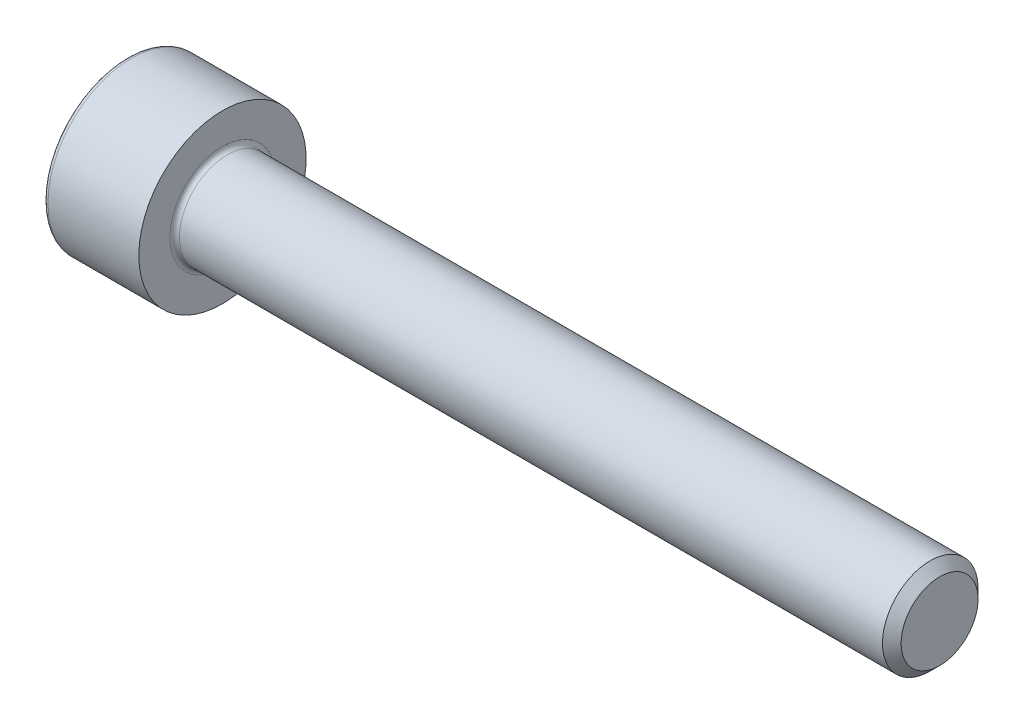
ISO-10303-21;
HEADER;
FILE_DESCRIPTION(('STEP AP214'),'2;1');
FILE_NAME('part.step','',(''),(''),'','','');
FILE_SCHEMA(('AUTOMOTIVE_DESIGN { 1 0 10303 214 1 1 1 1 }'));
ENDSEC;
DATA;
#1=APPLICATION_CONTEXT('core data for automotive mechanical design processes');
#2=APPLICATION_PROTOCOL_DEFINITION('international standard','automotive_design',2000,#1);
#3=PRODUCT_CONTEXT('',#1,'mechanical');
#4=PRODUCT('Part','Part','',(#3));
#5=PRODUCT_RELATED_PRODUCT_CATEGORY('part','',(#4));
#6=PRODUCT_DEFINITION_FORMATION('','',#4);
#7=PRODUCT_DEFINITION_CONTEXT('part definition',#1,'design');
#8=PRODUCT_DEFINITION('design','',#6,#7);
#9=PRODUCT_DEFINITION_SHAPE('','',#8);
#10=(LENGTH_UNIT() NAMED_UNIT(*) SI_UNIT(.MILLI.,.METRE.));
#11=(NAMED_UNIT(*) PLANE_ANGLE_UNIT() SI_UNIT($,.RADIAN.));
#12=(NAMED_UNIT(*) SI_UNIT($,.STERADIAN.) SOLID_ANGLE_UNIT());
#13=UNCERTAINTY_MEASURE_WITH_UNIT(LENGTH_MEASURE(1.E-05),#10,'distance_accuracy_value','');
#14=(GEOMETRIC_REPRESENTATION_CONTEXT(3) GLOBAL_UNCERTAINTY_ASSIGNED_CONTEXT((#13)) GLOBAL_UNIT_ASSIGNED_CONTEXT((#10,
#11,#12)) REPRESENTATION_CONTEXT('',''));
#15=CARTESIAN_POINT('',(0.,0.,0.));
#16=DIRECTION('',(0.,0.,1.));
#17=DIRECTION('',(1.,0.,0.));
#18=AXIS2_PLACEMENT_3D('',#15,#16,#17);
#19=CARTESIAN_POINT('',(0.,0.,0.));
#20=DIRECTION('',(-1.,0.,0.));
#21=DIRECTION('',(0.,0.,1.));
#22=AXIS2_PLACEMENT_3D('',#19,#20,#21);
#23=PLANE('',#22);
#24=DIRECTION('',(0.,-0.499999999999999,0.866025403784439));
#25=VECTOR('',#24,1.);
#26=CARTESIAN_POINT('',(0.,1.77304267668134,0.));
#27=LINE('',#26,#25);
#28=CARTESIAN_POINT('',(0.,1.77304267668134,0.));
#29=VERTEX_POINT('',#28);
#30=CARTESIAN_POINT('',(0.,0.886521338340669,1.5355));
#31=VERTEX_POINT('',#30);
#32=EDGE_CURVE('E259',#29,#31,#27,.T.);
#33=ORIENTED_EDGE('',*,*,#32,.T.);
#34=DIRECTION('',(0.,1.,0.));
#35=VECTOR('',#34,1.);
#36=CARTESIAN_POINT('',(0.,-0.886521338340673,1.5355));
#37=LINE('',#36,#35);
#38=CARTESIAN_POINT('',(0.,-0.886521338340673,1.5355));
#39=VERTEX_POINT('',#38);
#40=EDGE_CURVE('E131',#39,#31,#37,.T.);
#41=ORIENTED_EDGE('',*,*,#40,.F.);
#42=DIRECTION('',(0.,-0.500000000000001,-0.866025403784438));
#43=VECTOR('',#42,1.);
#44=CARTESIAN_POINT('',(0.,-0.886521338340673,1.5355));
#45=LINE('',#44,#43);
#46=CARTESIAN_POINT('',(0.,-1.77304267668134,0.));
#47=VERTEX_POINT('',#46);
#48=EDGE_CURVE('E262',#39,#47,#45,.T.);
#49=ORIENTED_EDGE('',*,*,#48,.T.);
#50=DIRECTION('',(0.,0.499999999999999,-0.866025403784439));
#51=VECTOR('',#50,1.);
#52=CARTESIAN_POINT('',(0.,-1.77304267668134,0.));
#53=LINE('',#52,#51);
#54=CARTESIAN_POINT('',(0.,-0.886521338340676,-1.5355));
#55=VERTEX_POINT('',#54);
#56=EDGE_CURVE('E265',#47,#55,#53,.T.);
#57=ORIENTED_EDGE('',*,*,#56,.T.);
#58=DIRECTION('',(0.,-1.,0.));
#59=VECTOR('',#58,1.);
#60=CARTESIAN_POINT('',(0.,0.886521338340665,-1.5355));
#61=LINE('',#60,#59);
#62=CARTESIAN_POINT('',(0.,0.886521338340665,-1.5355));
#63=VERTEX_POINT('',#62);
#64=EDGE_CURVE('E268',#63,#55,#61,.T.);
#65=ORIENTED_EDGE('',*,*,#64,.F.);
#66=DIRECTION('',(0.,-0.500000000000001,-0.866025403784438));
#67=VECTOR('',#66,1.);
#68=CARTESIAN_POINT('',(0.,1.77304267668134,0.));
#69=LINE('',#68,#67);
#70=EDGE_CURVE('E126',#29,#63,#69,.T.);
#71=ORIENTED_EDGE('',*,*,#70,.F.);
#72=EDGE_LOOP('',(#33,#41,#49,#57,#65,#71));
#73=FACE_BOUND('',#72,.T.);
#74=CARTESIAN_POINT('',(0.,0.,0.));
#75=DIRECTION('',(-1.,0.,0.));
#76=DIRECTION('',(0.,0.,1.));
#77=AXIS2_PLACEMENT_3D('',#74,#75,#76);
#78=CIRCLE('',#77,3.3);
#79=CARTESIAN_POINT('',(0.,0.,3.3));
#80=VERTEX_POINT('',#79);
#81=EDGE_CURVE('E43',#80,#80,#78,.T.);
#82=ORIENTED_EDGE('',*,*,#81,.T.);
#83=EDGE_LOOP('',(#82));
#84=FACE_BOUND('',#83,.T.);
#85=ADVANCED_FACE('F35',(#73,#84),#23,.T.);
#86=CARTESIAN_POINT('',(-31.75,0.,0.));
#87=DIRECTION('',(-1.,0.,0.));
#88=DIRECTION('',(0.,0.,1.));
#89=AXIS2_PLACEMENT_3D('',#86,#87,#88);
#90=CYLINDRICAL_SURFACE('',#89,3.5);
#91=CARTESIAN_POINT('',(0.199999999999999,0.,0.));
#92=DIRECTION('',(-1.,0.,0.));
#93=DIRECTION('',(0.,0.,1.));
#94=AXIS2_PLACEMENT_3D('',#91,#92,#93);
#95=CIRCLE('',#94,3.5);
#96=CARTESIAN_POINT('',(0.199999999999999,0.,3.5));
#97=VERTEX_POINT('',#96);
#98=EDGE_CURVE('E11',#97,#97,#95,.F.);
#99=ORIENTED_EDGE('',*,*,#98,.T.);
#100=EDGE_LOOP('',(#99));
#101=FACE_BOUND('',#100,.T.);
#102=CARTESIAN_POINT('',(4.,0.,0.));
#103=DIRECTION('',(-1.,0.,0.));
#104=DIRECTION('',(0.,0.,1.));
#105=AXIS2_PLACEMENT_3D('',#102,#103,#104);
#106=CIRCLE('',#105,3.5);
#107=CARTESIAN_POINT('',(4.,0.,3.5));
#108=VERTEX_POINT('',#107);
#109=EDGE_CURVE('E149',#108,#108,#106,.T.);
#110=ORIENTED_EDGE('',*,*,#109,.T.);
#111=EDGE_LOOP('',(#110));
#112=FACE_BOUND('',#111,.T.);
#113=ADVANCED_FACE('F173',(#101,#112),#90,.T.);
#114=CARTESIAN_POINT('',(4.,3.5,0.));
#115=DIRECTION('',(1.,0.,0.));
#116=DIRECTION('',(0.,0.,-1.));
#117=AXIS2_PLACEMENT_3D('',#114,#115,#116);
#118=PLANE('',#117);
#119=CARTESIAN_POINT('',(4.,0.,0.));
#120=DIRECTION('',(1.,0.,0.));
#121=DIRECTION('',(0.,0.,-1.));
#122=AXIS2_PLACEMENT_3D('',#119,#120,#121);
#123=CIRCLE('',#122,2.19999999999997);
#124=CARTESIAN_POINT('',(4.,0.,-2.19999999999997));
#125=VERTEX_POINT('',#124);
#126=EDGE_CURVE('E152',#125,#125,#123,.F.);
#127=ORIENTED_EDGE('',*,*,#126,.T.);
#128=EDGE_LOOP('',(#127));
#129=FACE_BOUND('',#128,.T.);
#130=ORIENTED_EDGE('',*,*,#109,.F.);
#131=EDGE_LOOP('',(#130));
#132=FACE_BOUND('',#131,.T.);
#133=ADVANCED_FACE('F179',(#129,#132),#118,.T.);
#134=CARTESIAN_POINT('',(-31.75,0.,0.));
#135=DIRECTION('',(-1.,0.,0.));
#136=DIRECTION('',(0.,0.,1.));
#137=AXIS2_PLACEMENT_3D('',#134,#135,#136);
#138=CYLINDRICAL_SURFACE('',#137,1.99999999999997);
#139=CARTESIAN_POINT('',(4.2,0.,0.));
#140=DIRECTION('',(1.,0.,0.));
#141=DIRECTION('',(0.,0.,-1.));
#142=AXIS2_PLACEMENT_3D('',#139,#140,#141);
#143=CIRCLE('',#142,1.99999999999997);
#144=CARTESIAN_POINT('',(4.2,0.,-1.99999999999997));
#145=VERTEX_POINT('',#144);
#146=EDGE_CURVE('E155',#145,#145,#143,.T.);
#147=ORIENTED_EDGE('',*,*,#146,.T.);
#148=EDGE_LOOP('',(#147));
#149=FACE_BOUND('',#148,.T.);
#150=CARTESIAN_POINT('',(33.61,0.,0.));
#151=DIRECTION('',(-1.,0.,0.));
#152=DIRECTION('',(0.,0.,1.));
#153=AXIS2_PLACEMENT_3D('',#150,#151,#152);
#154=CIRCLE('',#153,1.99999999999994);
#155=CARTESIAN_POINT('',(33.61,0.,1.99999999999994));
#156=VERTEX_POINT('',#155);
#157=EDGE_CURVE('E146',#156,#156,#154,.T.);
#158=ORIENTED_EDGE('',*,*,#157,.T.);
#159=EDGE_LOOP('',(#158));
#160=FACE_BOUND('',#159,.T.);
#161=ADVANCED_FACE('F185',(#149,#160),#138,.T.);
#162=CARTESIAN_POINT('',(34.,0.,0.));
#163=DIRECTION('',(-1.,0.,0.));
#164=DIRECTION('',(0.,0.,1.));
#165=AXIS2_PLACEMENT_3D('',#162,#163,#164);
#166=CONICAL_SURFACE('',#165,1.61,0.785398163397317);
#167=ORIENTED_EDGE('',*,*,#157,.F.);
#168=EDGE_LOOP('',(#167));
#169=FACE_BOUND('',#168,.T.);
#170=CARTESIAN_POINT('',(34.,0.,0.));
#171=DIRECTION('',(-1.,0.,0.));
#172=DIRECTION('',(0.,0.,1.));
#173=AXIS2_PLACEMENT_3D('',#170,#171,#172);
#174=CIRCLE('',#173,1.61);
#175=CARTESIAN_POINT('',(34.,0.,1.61));
#176=VERTEX_POINT('',#175);
#177=EDGE_CURVE('E142',#176,#176,#174,.T.);
#178=ORIENTED_EDGE('',*,*,#177,.T.);
#179=EDGE_LOOP('',(#178));
#180=FACE_BOUND('',#179,.T.);
#181=ADVANCED_FACE('F189',(#169,#180),#166,.T.);
#182=CARTESIAN_POINT('',(34.,1.61,0.));
#183=DIRECTION('',(1.,0.,0.));
#184=DIRECTION('',(0.,0.,-1.));
#185=AXIS2_PLACEMENT_3D('',#182,#183,#184);
#186=PLANE('',#185);
#187=ORIENTED_EDGE('',*,*,#177,.F.);
#188=EDGE_LOOP('',(#187));
#189=FACE_BOUND('',#188,.T.);
#190=ADVANCED_FACE('F169',(#189),#186,.T.);
#191=CARTESIAN_POINT('',(4.2,0.,0.));
#192=DIRECTION('',(1.,0.,0.));
#193=DIRECTION('',(0.,0.,-1.));
#194=AXIS2_PLACEMENT_3D('',#191,#192,#193);
#195=TOROIDAL_SURFACE('',#194,2.19999999999997,0.2);
#196=ORIENTED_EDGE('',*,*,#146,.F.);
#197=EDGE_LOOP('',(#196));
#198=FACE_BOUND('',#197,.T.);
#199=ORIENTED_EDGE('',*,*,#126,.F.);
#200=EDGE_LOOP('',(#199));
#201=FACE_BOUND('',#200,.T.);
#202=ADVANCED_FACE('F162',(#198,#201),#195,.F.);
#203=CARTESIAN_POINT('',(0.199999999999999,0.,0.));
#204=DIRECTION('',(-1.,0.,0.));
#205=DIRECTION('',(0.,0.,1.));
#206=AXIS2_PLACEMENT_3D('',#203,#204,#205);
#207=TOROIDAL_SURFACE('',#206,3.3,0.2);
#208=ORIENTED_EDGE('',*,*,#98,.F.);
#209=EDGE_LOOP('',(#208));
#210=FACE_BOUND('',#209,.T.);
#211=ORIENTED_EDGE('',*,*,#81,.F.);
#212=EDGE_LOOP('',(#211));
#213=FACE_BOUND('',#212,.T.);
#214=ADVANCED_FACE('F37',(#210,#213),#207,.T.);
#215=CARTESIAN_POINT('',(2.,1.77304267668134,0.));
#216=DIRECTION('',(0.,-0.866025403784439,-0.5));
#217=DIRECTION('',(0.,0.499999999999999,-0.866025403784439));
#218=AXIS2_PLACEMENT_3D('',#215,#216,#217);
#219=PLANE('',#218);
#220=ORIENTED_EDGE('',*,*,#32,.F.);
#221=DIRECTION('',(-1.,0.,0.));
#222=VECTOR('',#221,1.);
#223=CARTESIAN_POINT('',(2.,1.77304267668134,0.));
#224=LINE('',#223,#222);
#225=CARTESIAN_POINT('',(2.,1.77304267668134,0.));
#226=VERTEX_POINT('',#225);
#227=EDGE_CURVE('E249',#226,#29,#224,.T.);
#228=ORIENTED_EDGE('',*,*,#227,.F.);
#229=DIRECTION('',(0.,-0.499999999999999,0.866025403784439));
#230=VECTOR('',#229,1.);
#231=CARTESIAN_POINT('',(2.,1.77304267668134,0.));
#232=LINE('',#231,#230);
#233=CARTESIAN_POINT('',(2.,1.329782007511,0.767749999999997));
#234=VERTEX_POINT('',#233);
#235=EDGE_CURVE('E118',#226,#234,#232,.T.);
#236=ORIENTED_EDGE('',*,*,#235,.T.);
#237=CARTESIAN_POINT('',(2.,0.886521338340669,1.5355));
#238=VERTEX_POINT('',#237);
#239=EDGE_CURVE('E109',#234,#238,#232,.T.);
#240=ORIENTED_EDGE('',*,*,#239,.T.);
#241=DIRECTION('',(-1.,0.,0.));
#242=VECTOR('',#241,1.);
#243=CARTESIAN_POINT('',(2.,0.886521338340669,1.5355));
#244=LINE('',#243,#242);
#245=EDGE_CURVE('E123',#238,#31,#244,.T.);
#246=ORIENTED_EDGE('',*,*,#245,.T.);
#247=EDGE_LOOP('',(#220,#228,#236,#240,#246));
#248=FACE_BOUND('',#247,.T.);
#249=ADVANCED_FACE('F122',(#248),#219,.T.);
#250=CARTESIAN_POINT('',(2.,-0.886521338340673,1.5355));
#251=DIRECTION('',(0.,0.,1.));
#252=DIRECTION('',(0.,-1.,0.));
#253=AXIS2_PLACEMENT_3D('',#250,#251,#252);
#254=PLANE('',#253);
#255=ORIENTED_EDGE('',*,*,#40,.T.);
#256=ORIENTED_EDGE('',*,*,#245,.F.);
#257=DIRECTION('',(0.,1.,0.));
#258=VECTOR('',#257,1.);
#259=CARTESIAN_POINT('',(2.,-0.886521338340673,1.5355));
#260=LINE('',#259,#258);
#261=CARTESIAN_POINT('',(2.,0.,1.5355));
#262=VERTEX_POINT('',#261);
#263=EDGE_CURVE('E106',#262,#238,#260,.T.);
#264=ORIENTED_EDGE('',*,*,#263,.F.);
#265=CARTESIAN_POINT('',(2.,-0.886521338340673,1.5355));
#266=VERTEX_POINT('',#265);
#267=EDGE_CURVE('E117',#266,#262,#260,.T.);
#268=ORIENTED_EDGE('',*,*,#267,.F.);
#269=DIRECTION('',(-1.,0.,0.));
#270=VECTOR('',#269,1.);
#271=CARTESIAN_POINT('',(2.,-0.886521338340673,1.5355));
#272=LINE('',#271,#270);
#273=EDGE_CURVE('E133',#266,#39,#272,.T.);
#274=ORIENTED_EDGE('',*,*,#273,.T.);
#275=EDGE_LOOP('',(#255,#256,#264,#268,#274));
#276=FACE_BOUND('',#275,.T.);
#277=ADVANCED_FACE('F128',(#276),#254,.F.);
#278=CARTESIAN_POINT('',(2.,-0.886521338340673,1.5355));
#279=DIRECTION('',(0.,0.866025403784438,-0.500000000000001));
#280=DIRECTION('',(0.,0.500000000000001,0.866025403784438));
#281=AXIS2_PLACEMENT_3D('',#278,#279,#280);
#282=PLANE('',#281);
#283=ORIENTED_EDGE('',*,*,#48,.F.);
#284=ORIENTED_EDGE('',*,*,#273,.F.);
#285=DIRECTION('',(0.,-0.500000000000001,-0.866025403784438));
#286=VECTOR('',#285,1.);
#287=CARTESIAN_POINT('',(2.,-0.886521338340673,1.5355));
#288=LINE('',#287,#286);
#289=CARTESIAN_POINT('',(2.,-1.32978200751101,0.767750000000003));
#290=VERTEX_POINT('',#289);
#291=EDGE_CURVE('E288',#266,#290,#288,.T.);
#292=ORIENTED_EDGE('',*,*,#291,.T.);
#293=CARTESIAN_POINT('',(2.,-1.77304267668134,0.));
#294=VERTEX_POINT('',#293);
#295=EDGE_CURVE('E277',#290,#294,#288,.T.);
#296=ORIENTED_EDGE('',*,*,#295,.T.);
#297=DIRECTION('',(-1.,0.,0.));
#298=VECTOR('',#297,1.);
#299=CARTESIAN_POINT('',(2.,-1.77304267668134,0.));
#300=LINE('',#299,#298);
#301=EDGE_CURVE('E138',#294,#47,#300,.T.);
#302=ORIENTED_EDGE('',*,*,#301,.T.);
#303=EDGE_LOOP('',(#283,#284,#292,#296,#302));
#304=FACE_BOUND('',#303,.T.);
#305=ADVANCED_FACE('F203',(#304),#282,.T.);
#306=CARTESIAN_POINT('',(2.,-1.77304267668134,0.));
#307=DIRECTION('',(0.,0.866025403784439,0.499999999999999));
#308=DIRECTION('',(0.,-0.499999999999999,0.866025403784439));
#309=AXIS2_PLACEMENT_3D('',#306,#307,#308);
#310=PLANE('',#309);
#311=ORIENTED_EDGE('',*,*,#56,.F.);
#312=ORIENTED_EDGE('',*,*,#301,.F.);
#313=DIRECTION('',(0.,0.499999999999999,-0.866025403784439));
#314=VECTOR('',#313,1.);
#315=CARTESIAN_POINT('',(2.,-1.77304267668134,0.));
#316=LINE('',#315,#314);
#317=CARTESIAN_POINT('',(2.,-1.32978200751101,-0.767750000000001));
#318=VERTEX_POINT('',#317);
#319=EDGE_CURVE('E255',#294,#318,#316,.T.);
#320=ORIENTED_EDGE('',*,*,#319,.T.);
#321=CARTESIAN_POINT('',(2.,-0.886521338340676,-1.5355));
#322=VERTEX_POINT('',#321);
#323=EDGE_CURVE('E287',#318,#322,#316,.T.);
#324=ORIENTED_EDGE('',*,*,#323,.T.);
#325=DIRECTION('',(-1.,0.,0.));
#326=VECTOR('',#325,1.);
#327=CARTESIAN_POINT('',(2.,-0.886521338340676,-1.5355));
#328=LINE('',#327,#326);
#329=EDGE_CURVE('E248',#322,#55,#328,.T.);
#330=ORIENTED_EDGE('',*,*,#329,.T.);
#331=EDGE_LOOP('',(#311,#312,#320,#324,#330));
#332=FACE_BOUND('',#331,.T.);
#333=ADVANCED_FACE('F206',(#332),#310,.T.);
#334=CARTESIAN_POINT('',(2.,0.886521338340665,-1.5355));
#335=DIRECTION('',(0.,0.,-1.));
#336=DIRECTION('',(0.,1.,0.));
#337=AXIS2_PLACEMENT_3D('',#334,#335,#336);
#338=PLANE('',#337);
#339=ORIENTED_EDGE('',*,*,#64,.T.);
#340=ORIENTED_EDGE('',*,*,#329,.F.);
#341=DIRECTION('',(0.,-1.,0.));
#342=VECTOR('',#341,1.);
#343=CARTESIAN_POINT('',(2.,0.886521338340665,-1.5355));
#344=LINE('',#343,#342);
#345=CARTESIAN_POINT('',(2.,0.,-1.5355));
#346=VERTEX_POINT('',#345);
#347=EDGE_CURVE('E252',#346,#322,#344,.T.);
#348=ORIENTED_EDGE('',*,*,#347,.F.);
#349=CARTESIAN_POINT('',(2.,0.886521338340665,-1.5355));
#350=VERTEX_POINT('',#349);
#351=EDGE_CURVE('E50',#350,#346,#344,.T.);
#352=ORIENTED_EDGE('',*,*,#351,.F.);
#353=DIRECTION('',(-1.,0.,0.));
#354=VECTOR('',#353,1.);
#355=CARTESIAN_POINT('',(2.,0.886521338340665,-1.5355));
#356=LINE('',#355,#354);
#357=EDGE_CURVE('E245',#350,#63,#356,.T.);
#358=ORIENTED_EDGE('',*,*,#357,.T.);
#359=EDGE_LOOP('',(#339,#340,#348,#352,#358));
#360=FACE_BOUND('',#359,.T.);
#361=ADVANCED_FACE('F210',(#360),#338,.F.);
#362=CARTESIAN_POINT('',(2.,1.77304267668134,0.));
#363=DIRECTION('',(0.,0.866025403784438,-0.500000000000001));
#364=DIRECTION('',(0.,0.500000000000001,0.866025403784438));
#365=AXIS2_PLACEMENT_3D('',#362,#363,#364);
#366=PLANE('',#365);
#367=ORIENTED_EDGE('',*,*,#70,.T.);
#368=ORIENTED_EDGE('',*,*,#357,.F.);
#369=DIRECTION('',(0.,-0.500000000000001,-0.866025403784438));
#370=VECTOR('',#369,1.);
#371=CARTESIAN_POINT('',(2.,1.77304267668134,0.));
#372=LINE('',#371,#370);
#373=CARTESIAN_POINT('',(2.,1.329782007511,-0.767750000000001));
#374=VERTEX_POINT('',#373);
#375=EDGE_CURVE('E235',#374,#350,#372,.T.);
#376=ORIENTED_EDGE('',*,*,#375,.F.);
#377=EDGE_CURVE('E241',#226,#374,#372,.T.);
#378=ORIENTED_EDGE('',*,*,#377,.F.);
#379=ORIENTED_EDGE('',*,*,#227,.T.);
#380=EDGE_LOOP('',(#367,#368,#376,#378,#379));
#381=FACE_BOUND('',#380,.T.);
#382=ADVANCED_FACE('F214',(#381),#366,.F.);
#383=CARTESIAN_POINT('',(2.,1.77304267668134,0.));
#384=DIRECTION('',(1.,0.,0.));
#385=DIRECTION('',(0.,0.,-1.));
#386=AXIS2_PLACEMENT_3D('',#383,#384,#385);
#387=PLANE('',#386);
#388=ORIENTED_EDGE('',*,*,#347,.T.);
#389=ORIENTED_EDGE('',*,*,#323,.F.);
#390=CARTESIAN_POINT('',(2.,0.,0.));
#391=DIRECTION('',(-1.,0.,0.));
#392=DIRECTION('',(0.,0.,1.));
#393=AXIS2_PLACEMENT_3D('',#390,#391,#392);
#394=CIRCLE('',#393,1.5355);
#395=EDGE_CURVE('E283',#346,#318,#394,.T.);
#396=ORIENTED_EDGE('',*,*,#395,.F.);
#397=EDGE_LOOP('',(#388,#389,#396));
#398=FACE_BOUND('',#397,.T.);
#399=ADVANCED_FACE('F218',(#398),#387,.F.);
#400=ORIENTED_EDGE('',*,*,#319,.F.);
#401=ORIENTED_EDGE('',*,*,#295,.F.);
#402=EDGE_CURVE('E136',#318,#290,#394,.T.);
#403=ORIENTED_EDGE('',*,*,#402,.F.);
#404=EDGE_LOOP('',(#400,#401,#403));
#405=FACE_BOUND('',#404,.T.);
#406=ADVANCED_FACE('F221',(#405),#387,.F.);
#407=ORIENTED_EDGE('',*,*,#291,.F.);
#408=ORIENTED_EDGE('',*,*,#267,.T.);
#409=EDGE_CURVE('E132',#290,#262,#394,.T.);
#410=ORIENTED_EDGE('',*,*,#409,.F.);
#411=EDGE_LOOP('',(#407,#408,#410));
#412=FACE_BOUND('',#411,.T.);
#413=ADVANCED_FACE('F226',(#412),#387,.F.);
#414=ORIENTED_EDGE('',*,*,#263,.T.);
#415=ORIENTED_EDGE('',*,*,#239,.F.);
#416=EDGE_CURVE('E112',#262,#234,#394,.T.);
#417=ORIENTED_EDGE('',*,*,#416,.F.);
#418=EDGE_LOOP('',(#414,#415,#417));
#419=FACE_BOUND('',#418,.T.);
#420=ADVANCED_FACE('F108',(#419),#387,.F.);
#421=ORIENTED_EDGE('',*,*,#235,.F.);
#422=ORIENTED_EDGE('',*,*,#377,.T.);
#423=EDGE_CURVE('E143',#234,#374,#394,.T.);
#424=ORIENTED_EDGE('',*,*,#423,.F.);
#425=EDGE_LOOP('',(#421,#422,#424));
#426=FACE_BOUND('',#425,.T.);
#427=ADVANCED_FACE('F229',(#426),#387,.F.);
#428=ORIENTED_EDGE('',*,*,#375,.T.);
#429=ORIENTED_EDGE('',*,*,#351,.T.);
#430=EDGE_CURVE('E238',#374,#346,#394,.T.);
#431=ORIENTED_EDGE('',*,*,#430,.F.);
#432=EDGE_LOOP('',(#428,#429,#431));
#433=FACE_BOUND('',#432,.T.);
#434=ADVANCED_FACE('F199',(#433),#387,.F.);
#435=CARTESIAN_POINT('',(2.,0.,0.));
#436=DIRECTION('',(-1.,0.,0.));
#437=DIRECTION('',(0.,0.,1.));
#438=AXIS2_PLACEMENT_3D('',#435,#436,#437);
#439=CONICAL_SURFACE('',#438,1.5355,1.04719755119659);
#440=CARTESIAN_POINT('',(2.88652133834068,0.,0.));
#441=VERTEX_POINT('',#440);
#442=VERTEX_LOOP('',#441);
#443=FACE_BOUND('',#442,.T.);
#444=ORIENTED_EDGE('',*,*,#416,.T.);
#445=ORIENTED_EDGE('',*,*,#423,.T.);
#446=ORIENTED_EDGE('',*,*,#430,.T.);
#447=ORIENTED_EDGE('',*,*,#395,.T.);
#448=ORIENTED_EDGE('',*,*,#402,.T.);
#449=ORIENTED_EDGE('',*,*,#409,.T.);
#450=EDGE_LOOP('',(#444,#445,#446,#447,#448,#449));
#451=FACE_BOUND('',#450,.T.);
#452=ADVANCED_FACE('F197',(#443,#451),#439,.F.);
#453=CLOSED_SHELL('',(#85,#113,#133,#161,#181,#190,#202,#214,#249,#277,#305,#333,#361,#382,#399,
#406,#413,#420,#427,#434,#452));
#454=MANIFOLD_SOLID_BREP('B2',#453);
#455=ADVANCED_BREP_SHAPE_REPRESENTATION('',(#18,#454),#14);
#456=SHAPE_DEFINITION_REPRESENTATION(#9,#455);
ENDSEC;
END-ISO-10303-21;
